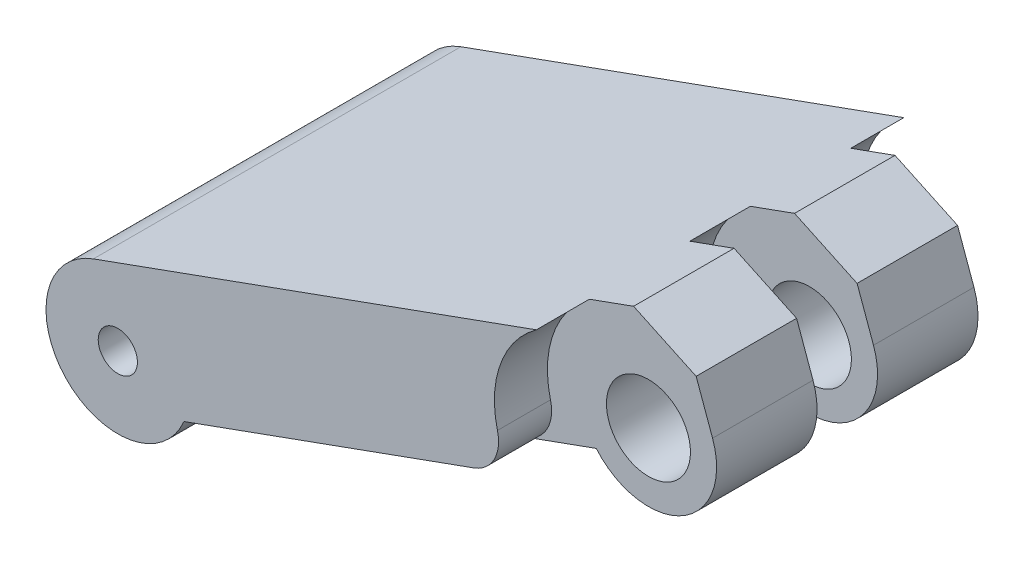
ISO-10303-21;
HEADER;
FILE_DESCRIPTION(('STEP AP214'),'2;1');
FILE_NAME('part.step','',(''),(''),'','','');
FILE_SCHEMA(('AUTOMOTIVE_DESIGN { 1 0 10303 214 1 1 1 1 }'));
ENDSEC;
DATA;
#1=APPLICATION_CONTEXT('core data for automotive mechanical design processes');
#2=APPLICATION_PROTOCOL_DEFINITION('international standard','automotive_design',2000,#1);
#3=PRODUCT_CONTEXT('',#1,'mechanical');
#4=PRODUCT('Part','Part','',(#3));
#5=PRODUCT_RELATED_PRODUCT_CATEGORY('part','',(#4));
#6=PRODUCT_DEFINITION_FORMATION('','',#4);
#7=PRODUCT_DEFINITION_CONTEXT('part definition',#1,'design');
#8=PRODUCT_DEFINITION('design','',#6,#7);
#9=PRODUCT_DEFINITION_SHAPE('','',#8);
#10=(LENGTH_UNIT() NAMED_UNIT(*) SI_UNIT(.MILLI.,.METRE.));
#11=(NAMED_UNIT(*) PLANE_ANGLE_UNIT() SI_UNIT($,.RADIAN.));
#12=(NAMED_UNIT(*) SI_UNIT($,.STERADIAN.) SOLID_ANGLE_UNIT());
#13=UNCERTAINTY_MEASURE_WITH_UNIT(LENGTH_MEASURE(1.E-05),#10,'distance_accuracy_value','');
#14=(GEOMETRIC_REPRESENTATION_CONTEXT(3) GLOBAL_UNCERTAINTY_ASSIGNED_CONTEXT((#13)) GLOBAL_UNIT_ASSIGNED_CONTEXT((#10,
#11,#12)) REPRESENTATION_CONTEXT('',''));
#15=CARTESIAN_POINT('',(0.,0.,0.));
#16=DIRECTION('',(0.,0.,1.));
#17=DIRECTION('',(1.,0.,0.));
#18=AXIS2_PLACEMENT_3D('',#15,#16,#17);
#19=CARTESIAN_POINT('',(7.1386775480851,33.9401415344497,19.68));
#20=DIRECTION('',(0.,0.,-1.));
#21=DIRECTION('',(-1.,0.,0.));
#22=AXIS2_PLACEMENT_3D('',#19,#20,#21);
#23=CYLINDRICAL_SURFACE('',#22,3.65015143439633);
#24=CARTESIAN_POINT('',(7.1386775480851,33.9401415344497,16.84));
#25=DIRECTION('',(0.,0.,-1.));
#26=DIRECTION('',(-1.,0.,0.));
#27=AXIS2_PLACEMENT_3D('',#24,#25,#26);
#28=CIRCLE('',#27,3.65015143439633);
#29=CARTESIAN_POINT('',(4.34421884081466,31.5918217037226,16.84));
#30=VERTEX_POINT('',#29);
#31=CARTESIAN_POINT('',(10.5716196670235,35.1805099885971,16.84));
#32=VERTEX_POINT('',#31);
#33=EDGE_CURVE('E199',#30,#32,#28,.F.);
#34=ORIENTED_EDGE('',*,*,#33,.F.);
#35=DIRECTION('',(0.,0.,1.));
#36=VECTOR('',#35,1.);
#37=CARTESIAN_POINT('',(4.34421884081466,31.5918217037226,19.68));
#38=LINE('',#37,#36);
#39=CARTESIAN_POINT('',(4.34421884081466,31.5918217037226,11.46));
#40=VERTEX_POINT('',#39);
#41=EDGE_CURVE('E245',#30,#40,#38,.F.);
#42=ORIENTED_EDGE('',*,*,#41,.T.);
#43=CARTESIAN_POINT('',(7.1386775480851,33.9401415344497,11.46));
#44=DIRECTION('',(0.,0.,-1.));
#45=DIRECTION('',(-1.,0.,0.));
#46=AXIS2_PLACEMENT_3D('',#43,#44,#45);
#47=CIRCLE('',#46,3.65015143439633);
#48=CARTESIAN_POINT('',(10.5716196670235,35.1805099885971,11.46));
#49=VERTEX_POINT('',#48);
#50=EDGE_CURVE('E20',#49,#40,#47,.T.);
#51=ORIENTED_EDGE('',*,*,#50,.F.);
#52=DIRECTION('',(0.,0.,1.));
#53=VECTOR('',#52,1.);
#54=CARTESIAN_POINT('',(10.5716196670235,35.1805099885971,19.68));
#55=LINE('',#54,#53);
#56=EDGE_CURVE('E153',#49,#32,#55,.T.);
#57=ORIENTED_EDGE('',*,*,#56,.T.);
#58=EDGE_LOOP('',(#34,#42,#51,#57));
#59=FACE_BOUND('',#58,.T.);
#60=ADVANCED_FACE('F17',(#59),#23,.T.);
#61=CARTESIAN_POINT('',(8.80381780536521,40.0732186418464,19.68));
#62=DIRECTION('',(-0.940493067380415,-0.339812875284882,0.));
#63=DIRECTION('',(0.339812875284882,-0.940493067380415,0.));
#64=AXIS2_PLACEMENT_3D('',#61,#62,#63);
#65=PLANE('',#64);
#66=DIRECTION('',(0.,0.,1.));
#67=VECTOR('',#66,1.);
#68=CARTESIAN_POINT('',(9.69286856262443,37.6126112471129,0.));
#69=LINE('',#68,#67);
#70=CARTESIAN_POINT('',(9.69286856262443,37.6126112471129,11.46));
#71=VERTEX_POINT('',#70);
#72=CARTESIAN_POINT('',(9.69286856262443,37.6126112471129,16.84));
#73=VERTEX_POINT('',#72);
#74=EDGE_CURVE('E207',#71,#73,#69,.T.);
#75=ORIENTED_EDGE('',*,*,#74,.T.);
#76=DIRECTION('',(-0.33981287528488,0.940493067380415,0.));
#77=VECTOR('',#76,1.);
#78=CARTESIAN_POINT('',(10.5716196670235,35.1805099885971,16.84));
#79=LINE('',#78,#77);
#80=EDGE_CURVE('E198',#32,#73,#79,.T.);
#81=ORIENTED_EDGE('',*,*,#80,.F.);
#82=ORIENTED_EDGE('',*,*,#56,.F.);
#83=DIRECTION('',(0.339812875284879,-0.940493067380416,0.));
#84=VECTOR('',#83,1.);
#85=CARTESIAN_POINT('',(9.69286856262443,37.6126112471129,11.46));
#86=LINE('',#85,#84);
#87=EDGE_CURVE('E217',#71,#49,#86,.T.);
#88=ORIENTED_EDGE('',*,*,#87,.F.);
#89=EDGE_LOOP('',(#75,#81,#82,#88));
#90=FACE_BOUND('',#89,.T.);
#91=ADVANCED_FACE('F370',(#90),#65,.F.);
#92=CARTESIAN_POINT('',(7.1386775480851,33.9401415344497,0.));
#93=DIRECTION('',(0.,0.,1.));
#94=DIRECTION('',(1.,0.,0.));
#95=AXIS2_PLACEMENT_3D('',#92,#93,#94);
#96=CYLINDRICAL_SURFACE('',#95,2.25);
#97=CARTESIAN_POINT('',(7.1386775480851,33.9401415344497,16.84));
#98=DIRECTION('',(0.,0.,1.));
#99=DIRECTION('',(1.,0.,0.));
#100=AXIS2_PLACEMENT_3D('',#97,#98,#99);
#101=CIRCLE('',#100,2.25);
#102=CARTESIAN_POINT('',(9.3886775480851,33.9401415344497,16.84));
#103=VERTEX_POINT('',#102);
#104=EDGE_CURVE('E195',#103,#103,#101,.F.);
#105=ORIENTED_EDGE('',*,*,#104,.F.);
#106=EDGE_LOOP('',(#105));
#107=FACE_BOUND('',#106,.T.);
#108=CARTESIAN_POINT('',(7.1386775480851,33.9401415344497,11.46));
#109=DIRECTION('',(0.,0.,1.));
#110=DIRECTION('',(1.,0.,0.));
#111=AXIS2_PLACEMENT_3D('',#108,#109,#110);
#112=CIRCLE('',#111,2.25);
#113=CARTESIAN_POINT('',(9.3886775480851,33.9401415344497,11.46));
#114=VERTEX_POINT('',#113);
#115=EDGE_CURVE('E205',#114,#114,#112,.T.);
#116=ORIENTED_EDGE('',*,*,#115,.F.);
#117=EDGE_LOOP('',(#116));
#118=FACE_BOUND('',#117,.T.);
#119=ADVANCED_FACE('F415',(#107,#118),#96,.F.);
#120=CARTESIAN_POINT('',(-0.0472481655726265,32.1316693511434,16.84));
#121=DIRECTION('',(0.,0.,1.));
#122=DIRECTION('',(1.,0.,0.));
#123=AXIS2_PLACEMENT_3D('',#120,#121,#122);
#124=CYLINDRICAL_SURFACE('',#123,2.);
#125=CARTESIAN_POINT('',(-0.0472481655726265,32.1316693511434,19.68));
#126=DIRECTION('',(0.,0.,1.));
#127=DIRECTION('',(1.,0.,0.));
#128=AXIS2_PLACEMENT_3D('',#125,#126,#127);
#129=CIRCLE('',#128,2.);
#130=CARTESIAN_POINT('',(0.632377584997137,30.2506832163825,19.68));
#131=VERTEX_POINT('',#130);
#132=CARTESIAN_POINT('',(1.89227294472635,32.619785999809,19.68));
#133=VERTEX_POINT('',#132);
#134=EDGE_CURVE('E184',#131,#133,#129,.T.);
#135=ORIENTED_EDGE('',*,*,#134,.F.);
#136=DIRECTION('',(0.,0.,1.));
#137=VECTOR('',#136,1.);
#138=CARTESIAN_POINT('',(0.632377584997137,30.2506832163825,19.68));
#139=LINE('',#138,#137);
#140=CARTESIAN_POINT('',(0.632377584997137,30.2506832163825,16.84));
#141=VERTEX_POINT('',#140);
#142=EDGE_CURVE('E250',#131,#141,#139,.F.);
#143=ORIENTED_EDGE('',*,*,#142,.T.);
#144=CARTESIAN_POINT('',(-0.0472481655726265,32.1316693511434,16.84));
#145=DIRECTION('',(0.,0.,1.));
#146=DIRECTION('',(1.,0.,0.));
#147=AXIS2_PLACEMENT_3D('',#144,#145,#146);
#148=CIRCLE('',#147,2.);
#149=CARTESIAN_POINT('',(1.89227294472635,32.619785999809,16.84));
#150=VERTEX_POINT('',#149);
#151=EDGE_CURVE('E202',#150,#141,#148,.F.);
#152=ORIENTED_EDGE('',*,*,#151,.F.);
#153=DIRECTION('',(0.,0.,1.));
#154=VECTOR('',#153,1.);
#155=CARTESIAN_POINT('',(1.89227294472635,32.619785999809,16.84));
#156=LINE('',#155,#154);
#157=EDGE_CURVE('E191',#150,#133,#156,.T.);
#158=ORIENTED_EDGE('',*,*,#157,.T.);
#159=EDGE_LOOP('',(#135,#143,#152,#158));
#160=FACE_BOUND('',#159,.T.);
#161=ADVANCED_FACE('F412',(#160),#124,.T.);
#162=CARTESIAN_POINT('',(-18.4395385936214,26.1396074447772,19.68));
#163=DIRECTION('',(0.,0.,-1.));
#164=DIRECTION('',(-1.,0.,0.));
#165=AXIS2_PLACEMENT_3D('',#162,#163,#164);
#166=CYLINDRICAL_SURFACE('',#165,1.05);
#167=CARTESIAN_POINT('',(-18.4395385936214,26.1396074447772,0.));
#168=DIRECTION('',(0.,0.,-1.));
#169=DIRECTION('',(-1.,0.,0.));
#170=AXIS2_PLACEMENT_3D('',#167,#168,#169);
#171=CIRCLE('',#170,1.05);
#172=CARTESIAN_POINT('',(-19.4895385936214,26.1396074447772,0.));
#173=VERTEX_POINT('',#172);
#174=EDGE_CURVE('E172',#173,#173,#171,.T.);
#175=ORIENTED_EDGE('',*,*,#174,.T.);
#176=EDGE_LOOP('',(#175));
#177=FACE_BOUND('',#176,.T.);
#178=CARTESIAN_POINT('',(-18.4395385936214,26.1396074447772,19.68));
#179=DIRECTION('',(0.,0.,-1.));
#180=DIRECTION('',(-1.,0.,0.));
#181=AXIS2_PLACEMENT_3D('',#178,#179,#180);
#182=CIRCLE('',#181,1.05);
#183=CARTESIAN_POINT('',(-19.4895385936214,26.1396074447772,19.68));
#184=VERTEX_POINT('',#183);
#185=EDGE_CURVE('E188',#184,#184,#182,.T.);
#186=ORIENTED_EDGE('',*,*,#185,.F.);
#187=EDGE_LOOP('',(#186));
#188=FACE_BOUND('',#187,.T.);
#189=ADVANCED_FACE('F414',(#177,#188),#166,.F.);
#190=CARTESIAN_POINT('',(-0.0472481655726265,32.1316693511434,2.84));
#191=DIRECTION('',(0.,0.,-1.));
#192=DIRECTION('',(-1.,0.,0.));
#193=AXIS2_PLACEMENT_3D('',#190,#191,#192);
#194=CYLINDRICAL_SURFACE('',#193,2.);
#195=CARTESIAN_POINT('',(-0.0472481655726265,32.1316693511434,0.));
#196=DIRECTION('',(0.,0.,-1.));
#197=DIRECTION('',(-1.,0.,0.));
#198=AXIS2_PLACEMENT_3D('',#195,#196,#197);
#199=CIRCLE('',#198,2.);
#200=CARTESIAN_POINT('',(0.632377584997136,30.2506832163825,0.));
#201=VERTEX_POINT('',#200);
#202=CARTESIAN_POINT('',(1.89227294472636,32.619785999809,0.));
#203=VERTEX_POINT('',#202);
#204=EDGE_CURVE('E151',#201,#203,#199,.F.);
#205=ORIENTED_EDGE('',*,*,#204,.T.);
#206=DIRECTION('',(0.,0.,-1.));
#207=VECTOR('',#206,1.);
#208=CARTESIAN_POINT('',(1.89227294472636,32.619785999809,2.84));
#209=LINE('',#208,#207);
#210=CARTESIAN_POINT('',(1.89227294472636,32.619785999809,2.84));
#211=VERTEX_POINT('',#210);
#212=EDGE_CURVE('E136',#203,#211,#209,.F.);
#213=ORIENTED_EDGE('',*,*,#212,.T.);
#214=CARTESIAN_POINT('',(-0.0472481655726265,32.1316693511434,2.84));
#215=DIRECTION('',(0.,0.,-1.));
#216=DIRECTION('',(-1.,0.,0.));
#217=AXIS2_PLACEMENT_3D('',#214,#215,#216);
#218=CIRCLE('',#217,2.);
#219=CARTESIAN_POINT('',(0.632377584997136,30.2506832163825,2.84));
#220=VERTEX_POINT('',#219);
#221=EDGE_CURVE('E144',#211,#220,#218,.T.);
#222=ORIENTED_EDGE('',*,*,#221,.T.);
#223=DIRECTION('',(0.,0.,1.));
#224=VECTOR('',#223,1.);
#225=CARTESIAN_POINT('',(0.632377584997135,30.2506832163825,19.68));
#226=LINE('',#225,#224);
#227=EDGE_CURVE('E152',#220,#201,#226,.F.);
#228=ORIENTED_EDGE('',*,*,#227,.T.);
#229=EDGE_LOOP('',(#205,#213,#222,#228));
#230=FACE_BOUND('',#229,.T.);
#231=ADVANCED_FACE('F149',(#230),#194,.T.);
#232=CARTESIAN_POINT('',(7.1386775480851,33.9401415344497,19.68));
#233=DIRECTION('',(0.,0.,-1.));
#234=DIRECTION('',(-1.,0.,0.));
#235=AXIS2_PLACEMENT_3D('',#232,#233,#234);
#236=CYLINDRICAL_SURFACE('',#235,3.65015143439633);
#237=DIRECTION('',(0.,0.,1.));
#238=VECTOR('',#237,1.);
#239=CARTESIAN_POINT('',(4.34421884081466,31.5918217037226,19.68));
#240=LINE('',#239,#238);
#241=CARTESIAN_POINT('',(4.34421884081466,31.5918217037226,8.22));
#242=VERTEX_POINT('',#241);
#243=CARTESIAN_POINT('',(4.34421884081465,31.5918217037226,2.84));
#244=VERTEX_POINT('',#243);
#245=EDGE_CURVE('E243',#242,#244,#240,.F.);
#246=ORIENTED_EDGE('',*,*,#245,.T.);
#247=CARTESIAN_POINT('',(7.1386775480851,33.9401415344497,2.84));
#248=DIRECTION('',(0.,0.,-1.));
#249=DIRECTION('',(-1.,0.,0.));
#250=AXIS2_PLACEMENT_3D('',#247,#248,#249);
#251=CIRCLE('',#250,3.65015143439633);
#252=CARTESIAN_POINT('',(10.5716196670235,35.1805099885971,2.84));
#253=VERTEX_POINT('',#252);
#254=EDGE_CURVE('E163',#244,#253,#251,.F.);
#255=ORIENTED_EDGE('',*,*,#254,.T.);
#256=DIRECTION('',(0.,0.,1.));
#257=VECTOR('',#256,1.);
#258=CARTESIAN_POINT('',(10.5716196670235,35.1805099885971,19.68));
#259=LINE('',#258,#257);
#260=CARTESIAN_POINT('',(10.5716196670235,35.1805099885971,8.22));
#261=VERTEX_POINT('',#260);
#262=EDGE_CURVE('E224',#253,#261,#259,.T.);
#263=ORIENTED_EDGE('',*,*,#262,.T.);
#264=CARTESIAN_POINT('',(7.1386775480851,33.9401415344497,8.22));
#265=DIRECTION('',(0.,0.,-1.));
#266=DIRECTION('',(-1.,0.,0.));
#267=AXIS2_PLACEMENT_3D('',#264,#265,#266);
#268=CIRCLE('',#267,3.65015143439633);
#269=EDGE_CURVE('E237',#261,#242,#268,.T.);
#270=ORIENTED_EDGE('',*,*,#269,.T.);
#271=EDGE_LOOP('',(#246,#255,#263,#270));
#272=FACE_BOUND('',#271,.T.);
#273=ADVANCED_FACE('F392',(#272),#236,.T.);
#274=CARTESIAN_POINT('',(4.34421884081466,31.5918217037226,19.68));
#275=DIRECTION('',(-0.339812875284882,0.940493067380415,0.));
#276=DIRECTION('',(-0.940493067380415,-0.339812875284882,0.));
#277=AXIS2_PLACEMENT_3D('',#274,#275,#276);
#278=PLANE('',#277);
#279=DIRECTION('',(-0.940493067380415,-0.339812875284882,0.));
#280=VECTOR('',#279,1.);
#281=CARTESIAN_POINT('',(4.34421884081466,31.5918217037226,8.22));
#282=LINE('',#281,#280);
#283=CARTESIAN_POINT('',(0.632377584997137,30.2506832163825,8.22));
#284=VERTEX_POINT('',#283);
#285=EDGE_CURVE('E273',#242,#284,#282,.T.);
#286=ORIENTED_EDGE('',*,*,#285,.T.);
#287=DIRECTION('',(0.,0.,1.));
#288=VECTOR('',#287,1.);
#289=CARTESIAN_POINT('',(0.632377584997138,30.2506832163825,8.22));
#290=LINE('',#289,#288);
#291=CARTESIAN_POINT('',(0.632377584997137,30.2506832163825,11.46));
#292=VERTEX_POINT('',#291);
#293=EDGE_CURVE('E233',#292,#284,#290,.F.);
#294=ORIENTED_EDGE('',*,*,#293,.F.);
#295=DIRECTION('',(-0.940493067380415,-0.339812875284882,0.));
#296=VECTOR('',#295,1.);
#297=CARTESIAN_POINT('',(4.34421884081466,31.5918217037226,11.46));
#298=LINE('',#297,#296);
#299=EDGE_CURVE('E209',#40,#292,#298,.T.);
#300=ORIENTED_EDGE('',*,*,#299,.F.);
#301=ORIENTED_EDGE('',*,*,#41,.F.);
#302=DIRECTION('',(0.940493067380415,0.339812875284882,0.));
#303=VECTOR('',#302,1.);
#304=CARTESIAN_POINT('',(0.632377584997139,30.2506832163825,16.84));
#305=LINE('',#304,#303);
#306=EDGE_CURVE('E201',#141,#30,#305,.T.);
#307=ORIENTED_EDGE('',*,*,#306,.F.);
#308=ORIENTED_EDGE('',*,*,#142,.F.);
#309=DIRECTION('',(0.940493067380415,0.339812875284882,0.));
#310=VECTOR('',#309,1.);
#311=CARTESIAN_POINT('',(-14.8972066270848,24.6396342399293,19.68));
#312=LINE('',#311,#310);
#313=CARTESIAN_POINT('',(-14.8972066270848,24.6396342399293,19.68));
#314=VERTEX_POINT('',#313);
#315=EDGE_CURVE('E187',#314,#131,#312,.T.);
#316=ORIENTED_EDGE('',*,*,#315,.F.);
#317=DIRECTION('',(0.,0.,1.));
#318=VECTOR('',#317,1.);
#319=CARTESIAN_POINT('',(-14.8972066270848,24.6396342399293,19.68));
#320=LINE('',#319,#318);
#321=CARTESIAN_POINT('',(-14.8972066270848,24.6396342399293,0.));
#322=VERTEX_POINT('',#321);
#323=EDGE_CURVE('E246',#322,#314,#320,.T.);
#324=ORIENTED_EDGE('',*,*,#323,.F.);
#325=DIRECTION('',(0.940493067380415,0.339812875284882,0.));
#326=VECTOR('',#325,1.);
#327=CARTESIAN_POINT('',(-14.8972066270848,24.6396342399293,0.));
#328=LINE('',#327,#326);
#329=EDGE_CURVE('E176',#322,#201,#328,.T.);
#330=ORIENTED_EDGE('',*,*,#329,.T.);
#331=ORIENTED_EDGE('',*,*,#227,.F.);
#332=DIRECTION('',(0.940493067380415,0.339812875284882,0.));
#333=VECTOR('',#332,1.);
#334=CARTESIAN_POINT('',(0.632377584997136,30.2506832163825,2.84));
#335=LINE('',#334,#333);
#336=EDGE_CURVE('E161',#220,#244,#335,.T.);
#337=ORIENTED_EDGE('',*,*,#336,.T.);
#338=ORIENTED_EDGE('',*,*,#245,.F.);
#339=EDGE_LOOP('',(#286,#294,#300,#301,#307,#308,#316,#324,#330,#331,#337,#338));
#340=FACE_BOUND('',#339,.T.);
#341=ADVANCED_FACE('F375',(#340),#278,.F.);
#342=CARTESIAN_POINT('',(8.80381780536521,40.0732186418464,19.68));
#343=DIRECTION('',(-0.940493067380415,-0.339812875284882,0.));
#344=DIRECTION('',(0.339812875284882,-0.940493067380415,0.));
#345=AXIS2_PLACEMENT_3D('',#342,#343,#344);
#346=PLANE('',#345);
#347=DIRECTION('',(0.339812875284879,-0.940493067380416,0.));
#348=VECTOR('',#347,1.);
#349=CARTESIAN_POINT('',(9.69286856262443,37.6126112471129,8.22));
#350=LINE('',#349,#348);
#351=CARTESIAN_POINT('',(9.69286856262443,37.6126112471129,8.22));
#352=VERTEX_POINT('',#351);
#353=EDGE_CURVE('E270',#352,#261,#350,.T.);
#354=ORIENTED_EDGE('',*,*,#353,.T.);
#355=ORIENTED_EDGE('',*,*,#262,.F.);
#356=DIRECTION('',(-0.33981287528488,0.940493067380415,0.));
#357=VECTOR('',#356,1.);
#358=CARTESIAN_POINT('',(10.5716196670235,35.1805099885971,2.84));
#359=LINE('',#358,#357);
#360=CARTESIAN_POINT('',(9.69286856262443,37.6126112471129,2.84));
#361=VERTEX_POINT('',#360);
#362=EDGE_CURVE('E299',#253,#361,#359,.T.);
#363=ORIENTED_EDGE('',*,*,#362,.T.);
#364=DIRECTION('',(0.,0.,1.));
#365=VECTOR('',#364,1.);
#366=CARTESIAN_POINT('',(9.69286856262443,37.6126112471129,0.));
#367=LINE('',#366,#365);
#368=EDGE_CURVE('E234',#361,#352,#367,.T.);
#369=ORIENTED_EDGE('',*,*,#368,.T.);
#370=EDGE_LOOP('',(#354,#355,#363,#369));
#371=FACE_BOUND('',#370,.T.);
#372=ADVANCED_FACE('F391',(#371),#346,.F.);
#373=CARTESIAN_POINT('',(7.1386775480851,33.9401415344497,0.));
#374=DIRECTION('',(0.,0.,1.));
#375=DIRECTION('',(1.,0.,0.));
#376=AXIS2_PLACEMENT_3D('',#373,#374,#375);
#377=CYLINDRICAL_SURFACE('',#376,2.25);
#378=CARTESIAN_POINT('',(7.1386775480851,33.9401415344497,2.84));
#379=DIRECTION('',(0.,0.,1.));
#380=DIRECTION('',(1.,0.,0.));
#381=AXIS2_PLACEMENT_3D('',#378,#379,#380);
#382=CIRCLE('',#381,2.25);
#383=CARTESIAN_POINT('',(9.3886775480851,33.9401415344497,2.84));
#384=VERTEX_POINT('',#383);
#385=EDGE_CURVE('E145',#384,#384,#382,.F.);
#386=ORIENTED_EDGE('',*,*,#385,.T.);
#387=EDGE_LOOP('',(#386));
#388=FACE_BOUND('',#387,.T.);
#389=CARTESIAN_POINT('',(7.1386775480851,33.9401415344497,8.22));
#390=DIRECTION('',(0.,0.,1.));
#391=DIRECTION('',(1.,0.,0.));
#392=AXIS2_PLACEMENT_3D('',#389,#390,#391);
#393=CIRCLE('',#392,2.25);
#394=CARTESIAN_POINT('',(9.3886775480851,33.9401415344497,8.22));
#395=VERTEX_POINT('',#394);
#396=EDGE_CURVE('E267',#395,#395,#393,.T.);
#397=ORIENTED_EDGE('',*,*,#396,.T.);
#398=EDGE_LOOP('',(#397));
#399=FACE_BOUND('',#398,.T.);
#400=ADVANCED_FACE('F461',(#388,#399),#377,.F.);
#401=CARTESIAN_POINT('',(-0.0472481655726265,32.1316693511434,8.22));
#402=DIRECTION('',(0.,0.,1.));
#403=DIRECTION('',(1.,0.,0.));
#404=AXIS2_PLACEMENT_3D('',#401,#402,#403);
#405=CYLINDRICAL_SURFACE('',#404,2.);
#406=DIRECTION('',(0.,0.,1.));
#407=VECTOR('',#406,1.);
#408=CARTESIAN_POINT('',(1.89227294472636,32.619785999809,8.22));
#409=LINE('',#408,#407);
#410=CARTESIAN_POINT('',(1.89227294472636,32.619785999809,8.22));
#411=VERTEX_POINT('',#410);
#412=CARTESIAN_POINT('',(1.89227294472636,32.619785999809,11.46));
#413=VERTEX_POINT('',#412);
#414=EDGE_CURVE('E227',#411,#413,#409,.T.);
#415=ORIENTED_EDGE('',*,*,#414,.T.);
#416=CARTESIAN_POINT('',(-0.0472481655726265,32.1316693511434,11.46));
#417=DIRECTION('',(0.,0.,1.));
#418=DIRECTION('',(1.,0.,0.));
#419=AXIS2_PLACEMENT_3D('',#416,#417,#418);
#420=CIRCLE('',#419,2.);
#421=EDGE_CURVE('E208',#292,#413,#420,.T.);
#422=ORIENTED_EDGE('',*,*,#421,.F.);
#423=ORIENTED_EDGE('',*,*,#293,.T.);
#424=CARTESIAN_POINT('',(-0.0472481655726265,32.1316693511434,8.22));
#425=DIRECTION('',(0.,0.,1.));
#426=DIRECTION('',(1.,0.,0.));
#427=AXIS2_PLACEMENT_3D('',#424,#425,#426);
#428=CIRCLE('',#427,2.);
#429=EDGE_CURVE('E271',#284,#411,#428,.T.);
#430=ORIENTED_EDGE('',*,*,#429,.T.);
#431=EDGE_LOOP('',(#415,#422,#423,#430));
#432=FACE_BOUND('',#431,.T.);
#433=ADVANCED_FACE('F377',(#432),#405,.T.);
#434=CARTESIAN_POINT('',(7.1386775480851,33.9401415344497,11.46));
#435=DIRECTION('',(0.,0.,-1.));
#436=DIRECTION('',(-1.,0.,0.));
#437=AXIS2_PLACEMENT_3D('',#434,#435,#436);
#438=PLANE('',#437);
#439=ORIENTED_EDGE('',*,*,#115,.T.);
#440=EDGE_LOOP('',(#439));
#441=FACE_BOUND('',#440,.T.);
#442=DIRECTION('',(0.940493067380415,0.339812875284882,0.));
#443=VECTOR('',#442,1.);
#444=CARTESIAN_POINT('',(8.80381780536521,40.0732186418464,11.46));
#445=LINE('',#444,#443);
#446=CARTESIAN_POINT('',(3.97451152787326,38.3283249167318,11.46));
#447=VERTEX_POINT('',#446);
#448=CARTESIAN_POINT('',(6.34321041063179,39.1841678845871,11.46));
#449=VERTEX_POINT('',#448);
#450=EDGE_CURVE('E230',#447,#449,#445,.T.);
#451=ORIENTED_EDGE('',*,*,#450,.T.);
#452=DIRECTION('',(0.905313014052065,-0.424745037155192,0.));
#453=VECTOR('',#452,1.);
#454=CARTESIAN_POINT('',(9.69286856262443,37.6126112471129,11.46));
#455=LINE('',#454,#453);
#456=EDGE_CURVE('E261',#449,#71,#455,.T.);
#457=ORIENTED_EDGE('',*,*,#456,.T.);
#458=ORIENTED_EDGE('',*,*,#87,.T.);
#459=ORIENTED_EDGE('',*,*,#50,.T.);
#460=ORIENTED_EDGE('',*,*,#299,.T.);
#461=ORIENTED_EDGE('',*,*,#421,.T.);
#462=CARTESIAN_POINT('',(7.1386775480851,33.9401415344497,11.46));
#463=DIRECTION('',(0.,0.,1.));
#464=DIRECTION('',(1.,0.,0.));
#465=AXIS2_PLACEMENT_3D('',#462,#463,#464);
#466=CIRCLE('',#465,5.41);
#467=EDGE_CURVE('E265',#413,#447,#466,.F.);
#468=ORIENTED_EDGE('',*,*,#467,.T.);
#469=EDGE_LOOP('',(#451,#457,#458,#459,#460,#461,#468));
#470=FACE_BOUND('',#469,.T.);
#471=ADVANCED_FACE('F350',(#441,#470),#438,.T.);
#472=CARTESIAN_POINT('',(9.69286856262443,37.6126112471129,0.));
#473=DIRECTION('',(-0.424745037155192,-0.905313014052065,0.));
#474=DIRECTION('',(0.905313014052065,-0.424745037155192,0.));
#475=AXIS2_PLACEMENT_3D('',#472,#473,#474);
#476=PLANE('',#475);
#477=DIRECTION('',(0.,0.,1.));
#478=VECTOR('',#477,1.);
#479=CARTESIAN_POINT('',(6.34321041063179,39.1841678845871,19.68));
#480=LINE('',#479,#478);
#481=CARTESIAN_POINT('',(6.34321041063179,39.1841678845871,16.84));
#482=VERTEX_POINT('',#481);
#483=EDGE_CURVE('E329',#449,#482,#480,.T.);
#484=ORIENTED_EDGE('',*,*,#483,.T.);
#485=DIRECTION('',(-0.905313014052065,0.424745037155192,0.));
#486=VECTOR('',#485,1.);
#487=CARTESIAN_POINT('',(9.69286856262443,37.6126112471129,16.84));
#488=LINE('',#487,#486);
#489=EDGE_CURVE('E204',#73,#482,#488,.T.);
#490=ORIENTED_EDGE('',*,*,#489,.F.);
#491=ORIENTED_EDGE('',*,*,#74,.F.);
#492=ORIENTED_EDGE('',*,*,#456,.F.);
#493=EDGE_LOOP('',(#484,#490,#491,#492));
#494=FACE_BOUND('',#493,.T.);
#495=ADVANCED_FACE('F361',(#494),#476,.F.);
#496=CARTESIAN_POINT('',(0.,0.,16.84));
#497=DIRECTION('',(0.,0.,1.));
#498=DIRECTION('',(1.,0.,0.));
#499=AXIS2_PLACEMENT_3D('',#496,#497,#498);
#500=PLANE('',#499);
#501=ORIENTED_EDGE('',*,*,#104,.T.);
#502=EDGE_LOOP('',(#501));
#503=FACE_BOUND('',#502,.T.);
#504=ORIENTED_EDGE('',*,*,#33,.T.);
#505=ORIENTED_EDGE('',*,*,#80,.T.);
#506=ORIENTED_EDGE('',*,*,#489,.T.);
#507=DIRECTION('',(0.940493067380415,0.339812875284882,0.));
#508=VECTOR('',#507,1.);
#509=CARTESIAN_POINT('',(8.80381780536521,40.0732186418464,16.84));
#510=LINE('',#509,#508);
#511=CARTESIAN_POINT('',(3.97451152787326,38.3283249167318,16.84));
#512=VERTEX_POINT('',#511);
#513=EDGE_CURVE('E326',#482,#512,#510,.F.);
#514=ORIENTED_EDGE('',*,*,#513,.T.);
#515=CARTESIAN_POINT('',(7.1386775480851,33.9401415344497,16.84));
#516=DIRECTION('',(0.,0.,1.));
#517=DIRECTION('',(1.,0.,0.));
#518=AXIS2_PLACEMENT_3D('',#515,#516,#517);
#519=CIRCLE('',#518,5.41);
#520=EDGE_CURVE('E192',#512,#150,#519,.T.);
#521=ORIENTED_EDGE('',*,*,#520,.T.);
#522=ORIENTED_EDGE('',*,*,#151,.T.);
#523=ORIENTED_EDGE('',*,*,#306,.T.);
#524=EDGE_LOOP('',(#504,#505,#506,#514,#521,#522,#523));
#525=FACE_BOUND('',#524,.T.);
#526=ADVANCED_FACE('F410',(#503,#525),#500,.T.);
#527=CARTESIAN_POINT('',(7.1386775480851,33.9401415344497,16.84));
#528=DIRECTION('',(0.,0.,1.));
#529=DIRECTION('',(1.,0.,0.));
#530=AXIS2_PLACEMENT_3D('',#527,#528,#529);
#531=CYLINDRICAL_SURFACE('',#530,5.41);
#532=ORIENTED_EDGE('',*,*,#157,.F.);
#533=ORIENTED_EDGE('',*,*,#520,.F.);
#534=DIRECTION('',(0.,0.,1.));
#535=VECTOR('',#534,1.);
#536=CARTESIAN_POINT('',(3.97451152787326,38.3283249167318,19.68));
#537=LINE('',#536,#535);
#538=CARTESIAN_POINT('',(3.97451152787326,38.3283249167318,19.68));
#539=VERTEX_POINT('',#538);
#540=EDGE_CURVE('E321',#512,#539,#537,.T.);
#541=ORIENTED_EDGE('',*,*,#540,.T.);
#542=CARTESIAN_POINT('',(7.1386775480851,33.9401415344497,19.68));
#543=DIRECTION('',(0.,0.,1.));
#544=DIRECTION('',(1.,0.,0.));
#545=AXIS2_PLACEMENT_3D('',#542,#543,#544);
#546=CIRCLE('',#545,5.41);
#547=EDGE_CURVE('E182',#133,#539,#546,.F.);
#548=ORIENTED_EDGE('',*,*,#547,.F.);
#549=EDGE_LOOP('',(#532,#533,#541,#548));
#550=FACE_BOUND('',#549,.T.);
#551=ADVANCED_FACE('F409',(#550),#531,.F.);
#552=CARTESIAN_POINT('',(7.1386775480851,33.9401415344497,19.68));
#553=DIRECTION('',(0.,0.,1.));
#554=DIRECTION('',(1.,0.,0.));
#555=AXIS2_PLACEMENT_3D('',#552,#553,#554);
#556=PLANE('',#555);
#557=CARTESIAN_POINT('',(-18.4395385936214,26.1396074447772,19.68));
#558=DIRECTION('',(0.,0.,-1.));
#559=DIRECTION('',(-1.,0.,0.));
#560=AXIS2_PLACEMENT_3D('',#557,#558,#559);
#561=CIRCLE('',#560,3.84682146406728);
#562=CARTESIAN_POINT('',(-19.7467380560337,29.7575163631826,19.68));
#563=VERTEX_POINT('',#562);
#564=EDGE_CURVE('E180',#314,#563,#561,.T.);
#565=ORIENTED_EDGE('',*,*,#564,.F.);
#566=ORIENTED_EDGE('',*,*,#315,.T.);
#567=ORIENTED_EDGE('',*,*,#134,.T.);
#568=ORIENTED_EDGE('',*,*,#547,.T.);
#569=DIRECTION('',(0.940493067380415,0.339812875284882,0.));
#570=VECTOR('',#569,1.);
#571=CARTESIAN_POINT('',(8.80381780536521,40.0732186418464,19.68));
#572=LINE('',#571,#570);
#573=EDGE_CURVE('E318',#539,#563,#572,.F.);
#574=ORIENTED_EDGE('',*,*,#573,.T.);
#575=EDGE_LOOP('',(#565,#566,#567,#568,#574));
#576=FACE_BOUND('',#575,.T.);
#577=ORIENTED_EDGE('',*,*,#185,.T.);
#578=EDGE_LOOP('',(#577));
#579=FACE_BOUND('',#578,.T.);
#580=ADVANCED_FACE('F403',(#576,#579),#556,.T.);
#581=CARTESIAN_POINT('',(-18.4395385936214,26.1396074447772,19.68));
#582=DIRECTION('',(0.,0.,-1.));
#583=DIRECTION('',(-1.,0.,0.));
#584=AXIS2_PLACEMENT_3D('',#581,#582,#583);
#585=CYLINDRICAL_SURFACE('',#584,3.84682146406728);
#586=DIRECTION('',(0.,0.,1.));
#587=VECTOR('',#586,1.);
#588=CARTESIAN_POINT('',(-19.7467380560337,29.7575163631826,19.68));
#589=LINE('',#588,#587);
#590=CARTESIAN_POINT('',(-19.7467380560337,29.7575163631826,0.));
#591=VERTEX_POINT('',#590);
#592=EDGE_CURVE('E313',#563,#591,#589,.F.);
#593=ORIENTED_EDGE('',*,*,#592,.T.);
#594=CARTESIAN_POINT('',(-18.4395385936214,26.1396074447772,0.));
#595=DIRECTION('',(0.,0.,-1.));
#596=DIRECTION('',(-1.,0.,0.));
#597=AXIS2_PLACEMENT_3D('',#594,#595,#596);
#598=CIRCLE('',#597,3.84682146406728);
#599=EDGE_CURVE('E177',#591,#322,#598,.F.);
#600=ORIENTED_EDGE('',*,*,#599,.T.);
#601=ORIENTED_EDGE('',*,*,#323,.T.);
#602=ORIENTED_EDGE('',*,*,#564,.T.);
#603=EDGE_LOOP('',(#593,#600,#601,#602));
#604=FACE_BOUND('',#603,.T.);
#605=ADVANCED_FACE('F400',(#604),#585,.T.);
#606=CARTESIAN_POINT('',(7.1386775480851,33.9401415344497,0.));
#607=DIRECTION('',(0.,0.,1.));
#608=DIRECTION('',(1.,0.,0.));
#609=AXIS2_PLACEMENT_3D('',#606,#607,#608);
#610=PLANE('',#609);
#611=ORIENTED_EDGE('',*,*,#174,.F.);
#612=EDGE_LOOP('',(#611));
#613=FACE_BOUND('',#612,.T.);
#614=CARTESIAN_POINT('',(7.1386775480851,33.9401415344497,0.));
#615=DIRECTION('',(0.,0.,-1.));
#616=DIRECTION('',(-1.,0.,0.));
#617=AXIS2_PLACEMENT_3D('',#614,#615,#616);
#618=CIRCLE('',#617,5.41);
#619=CARTESIAN_POINT('',(3.97451152787325,38.3283249167318,0.));
#620=VERTEX_POINT('',#619);
#621=EDGE_CURVE('E170',#620,#203,#618,.F.);
#622=ORIENTED_EDGE('',*,*,#621,.T.);
#623=ORIENTED_EDGE('',*,*,#204,.F.);
#624=ORIENTED_EDGE('',*,*,#329,.F.);
#625=ORIENTED_EDGE('',*,*,#599,.F.);
#626=DIRECTION('',(0.940493067380415,0.339812875284882,0.));
#627=VECTOR('',#626,1.);
#628=CARTESIAN_POINT('',(8.80381780536521,40.0732186418464,0.));
#629=LINE('',#628,#627);
#630=EDGE_CURVE('E310',#591,#620,#629,.T.);
#631=ORIENTED_EDGE('',*,*,#630,.T.);
#632=EDGE_LOOP('',(#622,#623,#624,#625,#631));
#633=FACE_BOUND('',#632,.T.);
#634=ADVANCED_FACE('F395',(#613,#633),#610,.F.);
#635=CARTESIAN_POINT('',(7.1386775480851,33.9401415344497,2.84));
#636=DIRECTION('',(0.,0.,-1.));
#637=DIRECTION('',(-1.,0.,0.));
#638=AXIS2_PLACEMENT_3D('',#635,#636,#637);
#639=CYLINDRICAL_SURFACE('',#638,5.41);
#640=CARTESIAN_POINT('',(7.1386775480851,33.9401415344497,2.84));
#641=DIRECTION('',(0.,0.,-1.));
#642=DIRECTION('',(-1.,0.,0.));
#643=AXIS2_PLACEMENT_3D('',#640,#641,#642);
#644=CIRCLE('',#643,5.41);
#645=CARTESIAN_POINT('',(3.97451152787325,38.3283249167318,2.84));
#646=VERTEX_POINT('',#645);
#647=EDGE_CURVE('E133',#646,#211,#644,.F.);
#648=ORIENTED_EDGE('',*,*,#647,.T.);
#649=ORIENTED_EDGE('',*,*,#212,.F.);
#650=ORIENTED_EDGE('',*,*,#621,.F.);
#651=DIRECTION('',(0.,0.,1.));
#652=VECTOR('',#651,1.);
#653=CARTESIAN_POINT('',(3.97451152787325,38.3283249167318,19.68));
#654=LINE('',#653,#652);
#655=EDGE_CURVE('E139',#620,#646,#654,.T.);
#656=ORIENTED_EDGE('',*,*,#655,.T.);
#657=EDGE_LOOP('',(#648,#649,#650,#656));
#658=FACE_BOUND('',#657,.T.);
#659=ADVANCED_FACE('F135',(#658),#639,.F.);
#660=CARTESIAN_POINT('',(7.1386775480851,33.9401415344497,2.84));
#661=DIRECTION('',(0.,0.,1.));
#662=DIRECTION('',(1.,0.,0.));
#663=AXIS2_PLACEMENT_3D('',#660,#661,#662);
#664=PLANE('',#663);
#665=DIRECTION('',(0.905313014052065,-0.424745037155192,0.));
#666=VECTOR('',#665,1.);
#667=CARTESIAN_POINT('',(9.69286856262443,37.6126112471129,2.84));
#668=LINE('',#667,#666);
#669=CARTESIAN_POINT('',(6.34321041063179,39.1841678845871,2.84));
#670=VERTEX_POINT('',#669);
#671=EDGE_CURVE('E238',#670,#361,#668,.T.);
#672=ORIENTED_EDGE('',*,*,#671,.T.);
#673=ORIENTED_EDGE('',*,*,#362,.F.);
#674=ORIENTED_EDGE('',*,*,#254,.F.);
#675=ORIENTED_EDGE('',*,*,#336,.F.);
#676=ORIENTED_EDGE('',*,*,#221,.F.);
#677=ORIENTED_EDGE('',*,*,#647,.F.);
#678=DIRECTION('',(0.940493067380415,0.339812875284882,0.));
#679=VECTOR('',#678,1.);
#680=CARTESIAN_POINT('',(8.80381780536521,40.0732186418464,2.84));
#681=LINE('',#680,#679);
#682=EDGE_CURVE('E295',#646,#670,#681,.T.);
#683=ORIENTED_EDGE('',*,*,#682,.T.);
#684=EDGE_LOOP('',(#672,#673,#674,#675,#676,#677,#683));
#685=FACE_BOUND('',#684,.T.);
#686=ORIENTED_EDGE('',*,*,#385,.F.);
#687=EDGE_LOOP('',(#686));
#688=FACE_BOUND('',#687,.T.);
#689=ADVANCED_FACE('F157',(#685,#688),#664,.F.);
#690=CARTESIAN_POINT('',(9.69286856262443,37.6126112471129,0.));
#691=DIRECTION('',(-0.424745037155192,-0.905313014052065,0.));
#692=DIRECTION('',(0.905313014052065,-0.424745037155192,0.));
#693=AXIS2_PLACEMENT_3D('',#690,#691,#692);
#694=PLANE('',#693);
#695=DIRECTION('',(0.905313014052065,-0.424745037155192,0.));
#696=VECTOR('',#695,1.);
#697=CARTESIAN_POINT('',(6.34321041063179,39.1841678845871,8.22));
#698=LINE('',#697,#696);
#699=CARTESIAN_POINT('',(6.34321041063179,39.1841678845871,8.22));
#700=VERTEX_POINT('',#699);
#701=EDGE_CURVE('E272',#700,#352,#698,.T.);
#702=ORIENTED_EDGE('',*,*,#701,.T.);
#703=ORIENTED_EDGE('',*,*,#368,.F.);
#704=ORIENTED_EDGE('',*,*,#671,.F.);
#705=DIRECTION('',(0.,0.,1.));
#706=VECTOR('',#705,1.);
#707=CARTESIAN_POINT('',(6.34321041063179,39.1841678845871,19.68));
#708=LINE('',#707,#706);
#709=EDGE_CURVE('E286',#670,#700,#708,.T.);
#710=ORIENTED_EDGE('',*,*,#709,.T.);
#711=EDGE_LOOP('',(#702,#703,#704,#710));
#712=FACE_BOUND('',#711,.T.);
#713=ADVANCED_FACE('F385',(#712),#694,.F.);
#714=CARTESIAN_POINT('',(7.1386775480851,33.9401415344497,8.22));
#715=DIRECTION('',(0.,0.,-1.));
#716=DIRECTION('',(-1.,0.,0.));
#717=AXIS2_PLACEMENT_3D('',#714,#715,#716);
#718=PLANE('',#717);
#719=ORIENTED_EDGE('',*,*,#396,.F.);
#720=EDGE_LOOP('',(#719));
#721=FACE_BOUND('',#720,.T.);
#722=ORIENTED_EDGE('',*,*,#701,.F.);
#723=DIRECTION('',(0.940493067380415,0.339812875284882,0.));
#724=VECTOR('',#723,1.);
#725=CARTESIAN_POINT('',(8.80381780536521,40.0732186418464,8.22));
#726=LINE('',#725,#724);
#727=CARTESIAN_POINT('',(3.97451152787326,38.3283249167318,8.22));
#728=VERTEX_POINT('',#727);
#729=EDGE_CURVE('E26',#700,#728,#726,.F.);
#730=ORIENTED_EDGE('',*,*,#729,.T.);
#731=CARTESIAN_POINT('',(7.1386775480851,33.9401415344497,8.22));
#732=DIRECTION('',(0.,0.,1.));
#733=DIRECTION('',(1.,0.,0.));
#734=AXIS2_PLACEMENT_3D('',#731,#732,#733);
#735=CIRCLE('',#734,5.41);
#736=EDGE_CURVE('E34',#728,#411,#735,.T.);
#737=ORIENTED_EDGE('',*,*,#736,.T.);
#738=ORIENTED_EDGE('',*,*,#429,.F.);
#739=ORIENTED_EDGE('',*,*,#285,.F.);
#740=ORIENTED_EDGE('',*,*,#269,.F.);
#741=ORIENTED_EDGE('',*,*,#353,.F.);
#742=EDGE_LOOP('',(#722,#730,#737,#738,#739,#740,#741));
#743=FACE_BOUND('',#742,.T.);
#744=ADVANCED_FACE('F380',(#721,#743),#718,.F.);
#745=CARTESIAN_POINT('',(7.1386775480851,33.9401415344497,8.22));
#746=DIRECTION('',(0.,0.,1.));
#747=DIRECTION('',(1.,0.,0.));
#748=AXIS2_PLACEMENT_3D('',#745,#746,#747);
#749=CYLINDRICAL_SURFACE('',#748,5.41);
#750=ORIENTED_EDGE('',*,*,#736,.F.);
#751=DIRECTION('',(0.,0.,1.));
#752=VECTOR('',#751,1.);
#753=CARTESIAN_POINT('',(3.97451152787326,38.3283249167318,19.68));
#754=LINE('',#753,#752);
#755=EDGE_CURVE('E11',#728,#447,#754,.T.);
#756=ORIENTED_EDGE('',*,*,#755,.T.);
#757=ORIENTED_EDGE('',*,*,#467,.F.);
#758=ORIENTED_EDGE('',*,*,#414,.F.);
#759=EDGE_LOOP('',(#750,#756,#757,#758));
#760=FACE_BOUND('',#759,.T.);
#761=ADVANCED_FACE('F378',(#760),#749,.F.);
#762=CARTESIAN_POINT('',(8.80381780536521,40.0732186418464,19.68));
#763=DIRECTION('',(0.339812875284882,-0.940493067380415,0.));
#764=DIRECTION('',(0.940493067380415,0.339812875284882,0.));
#765=AXIS2_PLACEMENT_3D('',#762,#763,#764);
#766=PLANE('',#765);
#767=ORIENTED_EDGE('',*,*,#729,.F.);
#768=ORIENTED_EDGE('',*,*,#709,.F.);
#769=ORIENTED_EDGE('',*,*,#682,.F.);
#770=ORIENTED_EDGE('',*,*,#655,.F.);
#771=ORIENTED_EDGE('',*,*,#630,.F.);
#772=ORIENTED_EDGE('',*,*,#592,.F.);
#773=ORIENTED_EDGE('',*,*,#573,.F.);
#774=ORIENTED_EDGE('',*,*,#540,.F.);
#775=ORIENTED_EDGE('',*,*,#513,.F.);
#776=ORIENTED_EDGE('',*,*,#483,.F.);
#777=ORIENTED_EDGE('',*,*,#450,.F.);
#778=ORIENTED_EDGE('',*,*,#755,.F.);
#779=EDGE_LOOP('',(#767,#768,#769,#770,#771,#772,#773,#774,#775,#776,#777,#778));
#780=FACE_BOUND('',#779,.T.);
#781=ADVANCED_FACE('F356',(#780),#766,.F.);
#782=CLOSED_SHELL('',(#60,#91,#119,#161,#189,#231,#273,#341,#372,#400,#433,#471,#495,#526,#551,
#580,#605,#634,#659,#689,#713,#744,#761,#781));
#783=MANIFOLD_SOLID_BREP('B1',#782);
#784=ADVANCED_BREP_SHAPE_REPRESENTATION('',(#18,#783),#14);
#785=SHAPE_DEFINITION_REPRESENTATION(#9,#784);
ENDSEC;
END-ISO-10303-21;
